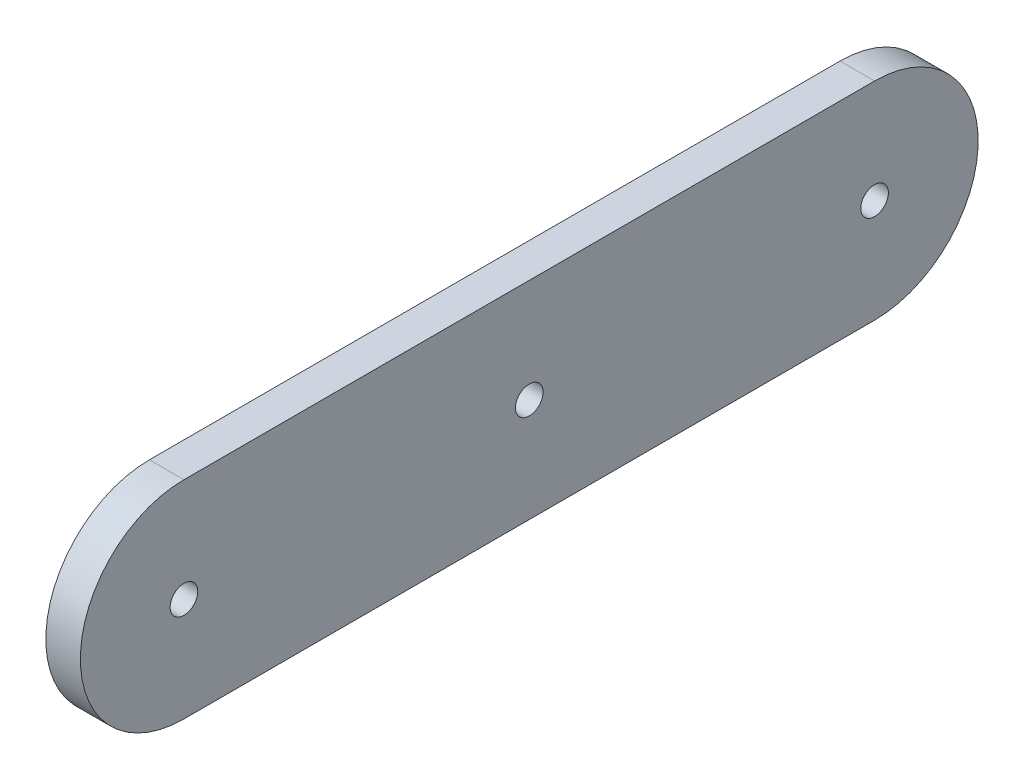
ISO-10303-21;
HEADER;
FILE_DESCRIPTION(('STEP AP214'),'2;1');
FILE_NAME('part.step','',(''),(''),'','','');
FILE_SCHEMA(('AUTOMOTIVE_DESIGN { 1 0 10303 214 1 1 1 1 }'));
ENDSEC;
DATA;
#1=APPLICATION_CONTEXT('core data for automotive mechanical design processes');
#2=APPLICATION_PROTOCOL_DEFINITION('international standard','automotive_design',2000,#1);
#3=PRODUCT_CONTEXT('',#1,'mechanical');
#4=PRODUCT('Part','Part','',(#3));
#5=PRODUCT_RELATED_PRODUCT_CATEGORY('part','',(#4));
#6=PRODUCT_DEFINITION_FORMATION('','',#4);
#7=PRODUCT_DEFINITION_CONTEXT('part definition',#1,'design');
#8=PRODUCT_DEFINITION('design','',#6,#7);
#9=PRODUCT_DEFINITION_SHAPE('','',#8);
#10=(LENGTH_UNIT() NAMED_UNIT(*) SI_UNIT(.MILLI.,.METRE.));
#11=(NAMED_UNIT(*) PLANE_ANGLE_UNIT() SI_UNIT($,.RADIAN.));
#12=(NAMED_UNIT(*) SI_UNIT($,.STERADIAN.) SOLID_ANGLE_UNIT());
#13=UNCERTAINTY_MEASURE_WITH_UNIT(LENGTH_MEASURE(1.E-05),#10,'distance_accuracy_value','');
#14=(GEOMETRIC_REPRESENTATION_CONTEXT(3) GLOBAL_UNCERTAINTY_ASSIGNED_CONTEXT((#13)) GLOBAL_UNIT_ASSIGNED_CONTEXT((#10,
#11,#12)) REPRESENTATION_CONTEXT('',''));
#15=CARTESIAN_POINT('',(0.,0.,0.));
#16=DIRECTION('',(0.,0.,1.));
#17=DIRECTION('',(1.,0.,0.));
#18=AXIS2_PLACEMENT_3D('',#15,#16,#17);
#19=CARTESIAN_POINT('',(5.,0.,50.));
#20=DIRECTION('',(-1.,0.,0.));
#21=DIRECTION('',(0.,0.,1.));
#22=AXIS2_PLACEMENT_3D('',#19,#20,#21);
#23=CYLINDRICAL_SURFACE('',#22,15.);
#24=CARTESIAN_POINT('',(0.,0.,50.));
#25=DIRECTION('',(1.,0.,0.));
#26=DIRECTION('',(0.,0.,-1.));
#27=AXIS2_PLACEMENT_3D('',#24,#25,#26);
#28=CIRCLE('',#27,15.);
#29=CARTESIAN_POINT('',(0.,15.,50.));
#30=VERTEX_POINT('',#29);
#31=CARTESIAN_POINT('',(0.,-15.,50.));
#32=VERTEX_POINT('',#31);
#33=EDGE_CURVE('E98',#30,#32,#28,.T.);
#34=ORIENTED_EDGE('',*,*,#33,.T.);
#35=DIRECTION('',(-1.,0.,0.));
#36=VECTOR('',#35,1.);
#37=CARTESIAN_POINT('',(5.,-15.,50.));
#38=LINE('',#37,#36);
#39=CARTESIAN_POINT('',(5.,-15.,50.));
#40=VERTEX_POINT('',#39);
#41=EDGE_CURVE('E11',#40,#32,#38,.T.);
#42=ORIENTED_EDGE('',*,*,#41,.F.);
#43=CARTESIAN_POINT('',(5.,0.,50.));
#44=DIRECTION('',(1.,0.,0.));
#45=DIRECTION('',(0.,0.,-1.));
#46=AXIS2_PLACEMENT_3D('',#43,#44,#45);
#47=CIRCLE('',#46,15.);
#48=CARTESIAN_POINT('',(5.,15.,50.));
#49=VERTEX_POINT('',#48);
#50=EDGE_CURVE('E86',#49,#40,#47,.T.);
#51=ORIENTED_EDGE('',*,*,#50,.F.);
#52=DIRECTION('',(-1.,0.,0.));
#53=VECTOR('',#52,1.);
#54=CARTESIAN_POINT('',(5.,15.,50.));
#55=LINE('',#54,#53);
#56=EDGE_CURVE('E94',#49,#30,#55,.T.);
#57=ORIENTED_EDGE('',*,*,#56,.T.);
#58=EDGE_LOOP('',(#34,#42,#51,#57));
#59=FACE_BOUND('',#58,.T.);
#60=ADVANCED_FACE('F35',(#59),#23,.T.);
#61=CARTESIAN_POINT('',(5.,-15.,50.));
#62=DIRECTION('',(0.,1.,0.));
#63=DIRECTION('',(0.,0.,1.));
#64=AXIS2_PLACEMENT_3D('',#61,#62,#63);
#65=PLANE('',#64);
#66=DIRECTION('',(0.,0.,-1.));
#67=VECTOR('',#66,1.);
#68=CARTESIAN_POINT('',(0.,-15.,50.));
#69=LINE('',#68,#67);
#70=CARTESIAN_POINT('',(0.,-15.,-50.));
#71=VERTEX_POINT('',#70);
#72=EDGE_CURVE('E90',#32,#71,#69,.T.);
#73=ORIENTED_EDGE('',*,*,#72,.T.);
#74=DIRECTION('',(-1.,0.,0.));
#75=VECTOR('',#74,1.);
#76=CARTESIAN_POINT('',(5.,-15.,-50.));
#77=LINE('',#76,#75);
#78=CARTESIAN_POINT('',(5.,-15.,-50.));
#79=VERTEX_POINT('',#78);
#80=EDGE_CURVE('E43',#79,#71,#77,.T.);
#81=ORIENTED_EDGE('',*,*,#80,.F.);
#82=DIRECTION('',(0.,0.,-1.));
#83=VECTOR('',#82,1.);
#84=CARTESIAN_POINT('',(5.,-15.,50.));
#85=LINE('',#84,#83);
#86=EDGE_CURVE('E81',#40,#79,#85,.T.);
#87=ORIENTED_EDGE('',*,*,#86,.F.);
#88=ORIENTED_EDGE('',*,*,#41,.T.);
#89=EDGE_LOOP('',(#73,#81,#87,#88));
#90=FACE_BOUND('',#89,.T.);
#91=ADVANCED_FACE('F89',(#90),#65,.F.);
#92=CARTESIAN_POINT('',(5.,0.,-50.));
#93=DIRECTION('',(-1.,0.,0.));
#94=DIRECTION('',(0.,0.,1.));
#95=AXIS2_PLACEMENT_3D('',#92,#93,#94);
#96=CYLINDRICAL_SURFACE('',#95,15.);
#97=CARTESIAN_POINT('',(0.,0.,-50.));
#98=DIRECTION('',(1.,0.,0.));
#99=DIRECTION('',(0.,0.,1.));
#100=AXIS2_PLACEMENT_3D('',#97,#98,#99);
#101=CIRCLE('',#100,15.);
#102=CARTESIAN_POINT('',(0.,15.,-50.));
#103=VERTEX_POINT('',#102);
#104=EDGE_CURVE('E68',#71,#103,#101,.T.);
#105=ORIENTED_EDGE('',*,*,#104,.T.);
#106=DIRECTION('',(-1.,0.,0.));
#107=VECTOR('',#106,1.);
#108=CARTESIAN_POINT('',(5.,15.,-50.));
#109=LINE('',#108,#107);
#110=CARTESIAN_POINT('',(5.,15.,-50.));
#111=VERTEX_POINT('',#110);
#112=EDGE_CURVE('E91',#111,#103,#109,.T.);
#113=ORIENTED_EDGE('',*,*,#112,.F.);
#114=CARTESIAN_POINT('',(5.,0.,-50.));
#115=DIRECTION('',(1.,0.,0.));
#116=DIRECTION('',(0.,0.,1.));
#117=AXIS2_PLACEMENT_3D('',#114,#115,#116);
#118=CIRCLE('',#117,15.);
#119=EDGE_CURVE('E84',#79,#111,#118,.T.);
#120=ORIENTED_EDGE('',*,*,#119,.F.);
#121=ORIENTED_EDGE('',*,*,#80,.T.);
#122=EDGE_LOOP('',(#105,#113,#120,#121));
#123=FACE_BOUND('',#122,.T.);
#124=ADVANCED_FACE('F92',(#123),#96,.T.);
#125=CARTESIAN_POINT('',(5.,15.,50.));
#126=DIRECTION('',(0.,-1.,0.));
#127=DIRECTION('',(0.,0.,-1.));
#128=AXIS2_PLACEMENT_3D('',#125,#126,#127);
#129=PLANE('',#128);
#130=DIRECTION('',(0.,0.,1.));
#131=VECTOR('',#130,1.);
#132=CARTESIAN_POINT('',(0.,15.,50.));
#133=LINE('',#132,#131);
#134=EDGE_CURVE('E74',#103,#30,#133,.T.);
#135=ORIENTED_EDGE('',*,*,#134,.T.);
#136=ORIENTED_EDGE('',*,*,#56,.F.);
#137=DIRECTION('',(0.,0.,1.));
#138=VECTOR('',#137,1.);
#139=CARTESIAN_POINT('',(5.,15.,50.));
#140=LINE('',#139,#138);
#141=EDGE_CURVE('E51',#111,#49,#140,.T.);
#142=ORIENTED_EDGE('',*,*,#141,.F.);
#143=ORIENTED_EDGE('',*,*,#112,.T.);
#144=EDGE_LOOP('',(#135,#136,#142,#143));
#145=FACE_BOUND('',#144,.T.);
#146=ADVANCED_FACE('F106',(#145),#129,.F.);
#147=CARTESIAN_POINT('',(5.,0.,50.));
#148=DIRECTION('',(1.,0.,0.));
#149=DIRECTION('',(0.,0.,-1.));
#150=AXIS2_PLACEMENT_3D('',#147,#148,#149);
#151=PLANE('',#150);
#152=CARTESIAN_POINT('',(5.,0.,-50.));
#153=DIRECTION('',(1.,0.,0.));
#154=DIRECTION('',(0.,0.,-1.));
#155=AXIS2_PLACEMENT_3D('',#152,#153,#154);
#156=CIRCLE('',#155,2.);
#157=CARTESIAN_POINT('',(5.,0.,-52.));
#158=VERTEX_POINT('',#157);
#159=EDGE_CURVE('E124',#158,#158,#156,.T.);
#160=ORIENTED_EDGE('',*,*,#159,.F.);
#161=EDGE_LOOP('',(#160));
#162=FACE_BOUND('',#161,.T.);
#163=CARTESIAN_POINT('',(5.,0.,0.));
#164=DIRECTION('',(1.,0.,0.));
#165=DIRECTION('',(0.,0.,-1.));
#166=AXIS2_PLACEMENT_3D('',#163,#164,#165);
#167=CIRCLE('',#166,2.);
#168=CARTESIAN_POINT('',(5.,0.,-2.));
#169=VERTEX_POINT('',#168);
#170=EDGE_CURVE('E118',#169,#169,#167,.T.);
#171=ORIENTED_EDGE('',*,*,#170,.F.);
#172=EDGE_LOOP('',(#171));
#173=FACE_BOUND('',#172,.T.);
#174=CARTESIAN_POINT('',(5.,0.,50.));
#175=DIRECTION('',(1.,0.,0.));
#176=DIRECTION('',(0.,0.,-1.));
#177=AXIS2_PLACEMENT_3D('',#174,#175,#176);
#178=CIRCLE('',#177,2.);
#179=CARTESIAN_POINT('',(5.,0.,48.));
#180=VERTEX_POINT('',#179);
#181=EDGE_CURVE('E112',#180,#180,#178,.T.);
#182=ORIENTED_EDGE('',*,*,#181,.F.);
#183=EDGE_LOOP('',(#182));
#184=FACE_BOUND('',#183,.T.);
#185=ORIENTED_EDGE('',*,*,#50,.T.);
#186=ORIENTED_EDGE('',*,*,#86,.T.);
#187=ORIENTED_EDGE('',*,*,#119,.T.);
#188=ORIENTED_EDGE('',*,*,#141,.T.);
#189=EDGE_LOOP('',(#185,#186,#187,#188));
#190=FACE_BOUND('',#189,.T.);
#191=ADVANCED_FACE('F82',(#162,#173,#184,#190),#151,.T.);
#192=CARTESIAN_POINT('',(0.,0.,50.));
#193=DIRECTION('',(1.,0.,0.));
#194=DIRECTION('',(0.,0.,-1.));
#195=AXIS2_PLACEMENT_3D('',#192,#193,#194);
#196=PLANE('',#195);
#197=CARTESIAN_POINT('',(0.,0.,-50.));
#198=DIRECTION('',(1.,0.,0.));
#199=DIRECTION('',(0.,0.,-1.));
#200=AXIS2_PLACEMENT_3D('',#197,#198,#199);
#201=CIRCLE('',#200,2.);
#202=CARTESIAN_POINT('',(0.,0.,-52.));
#203=VERTEX_POINT('',#202);
#204=EDGE_CURVE('E121',#203,#203,#201,.T.);
#205=ORIENTED_EDGE('',*,*,#204,.T.);
#206=EDGE_LOOP('',(#205));
#207=FACE_BOUND('',#206,.T.);
#208=CARTESIAN_POINT('',(0.,0.,0.));
#209=DIRECTION('',(1.,0.,0.));
#210=DIRECTION('',(0.,0.,-1.));
#211=AXIS2_PLACEMENT_3D('',#208,#209,#210);
#212=CIRCLE('',#211,2.);
#213=CARTESIAN_POINT('',(0.,0.,-2.));
#214=VERTEX_POINT('',#213);
#215=EDGE_CURVE('E115',#214,#214,#212,.T.);
#216=ORIENTED_EDGE('',*,*,#215,.T.);
#217=EDGE_LOOP('',(#216));
#218=FACE_BOUND('',#217,.T.);
#219=CARTESIAN_POINT('',(0.,0.,50.));
#220=DIRECTION('',(1.,0.,0.));
#221=DIRECTION('',(0.,0.,-1.));
#222=AXIS2_PLACEMENT_3D('',#219,#220,#221);
#223=CIRCLE('',#222,2.);
#224=CARTESIAN_POINT('',(0.,0.,48.));
#225=VERTEX_POINT('',#224);
#226=EDGE_CURVE('E101',#225,#225,#223,.T.);
#227=ORIENTED_EDGE('',*,*,#226,.T.);
#228=EDGE_LOOP('',(#227));
#229=FACE_BOUND('',#228,.T.);
#230=ORIENTED_EDGE('',*,*,#33,.F.);
#231=ORIENTED_EDGE('',*,*,#134,.F.);
#232=ORIENTED_EDGE('',*,*,#104,.F.);
#233=ORIENTED_EDGE('',*,*,#72,.F.);
#234=EDGE_LOOP('',(#230,#231,#232,#233));
#235=FACE_BOUND('',#234,.T.);
#236=ADVANCED_FACE('F109',(#207,#218,#229,#235),#196,.F.);
#237=CARTESIAN_POINT('',(0.,0.,50.));
#238=DIRECTION('',(1.,0.,0.));
#239=DIRECTION('',(0.,0.,-1.));
#240=AXIS2_PLACEMENT_3D('',#237,#238,#239);
#241=CYLINDRICAL_SURFACE('',#240,2.);
#242=ORIENTED_EDGE('',*,*,#226,.F.);
#243=EDGE_LOOP('',(#242));
#244=FACE_BOUND('',#243,.T.);
#245=ORIENTED_EDGE('',*,*,#181,.T.);
#246=EDGE_LOOP('',(#245));
#247=FACE_BOUND('',#246,.T.);
#248=ADVANCED_FACE('F146',(#244,#247),#241,.F.);
#249=CARTESIAN_POINT('',(0.,0.,0.));
#250=DIRECTION('',(1.,0.,0.));
#251=DIRECTION('',(0.,0.,-1.));
#252=AXIS2_PLACEMENT_3D('',#249,#250,#251);
#253=CYLINDRICAL_SURFACE('',#252,2.);
#254=ORIENTED_EDGE('',*,*,#215,.F.);
#255=EDGE_LOOP('',(#254));
#256=FACE_BOUND('',#255,.T.);
#257=ORIENTED_EDGE('',*,*,#170,.T.);
#258=EDGE_LOOP('',(#257));
#259=FACE_BOUND('',#258,.T.);
#260=ADVANCED_FACE('F135',(#256,#259),#253,.F.);
#261=CARTESIAN_POINT('',(0.,0.,-50.));
#262=DIRECTION('',(1.,0.,0.));
#263=DIRECTION('',(0.,0.,-1.));
#264=AXIS2_PLACEMENT_3D('',#261,#262,#263);
#265=CYLINDRICAL_SURFACE('',#264,2.);
#266=ORIENTED_EDGE('',*,*,#204,.F.);
#267=EDGE_LOOP('',(#266));
#268=FACE_BOUND('',#267,.T.);
#269=ORIENTED_EDGE('',*,*,#159,.T.);
#270=EDGE_LOOP('',(#269));
#271=FACE_BOUND('',#270,.T.);
#272=ADVANCED_FACE('F132',(#268,#271),#265,.F.);
#273=CLOSED_SHELL('',(#60,#91,#124,#146,#191,#236,#248,#260,#272));
#274=MANIFOLD_SOLID_BREP('B2',#273);
#275=ADVANCED_BREP_SHAPE_REPRESENTATION('',(#18,#274),#14);
#276=SHAPE_DEFINITION_REPRESENTATION(#9,#275);
ENDSEC;
END-ISO-10303-21;
